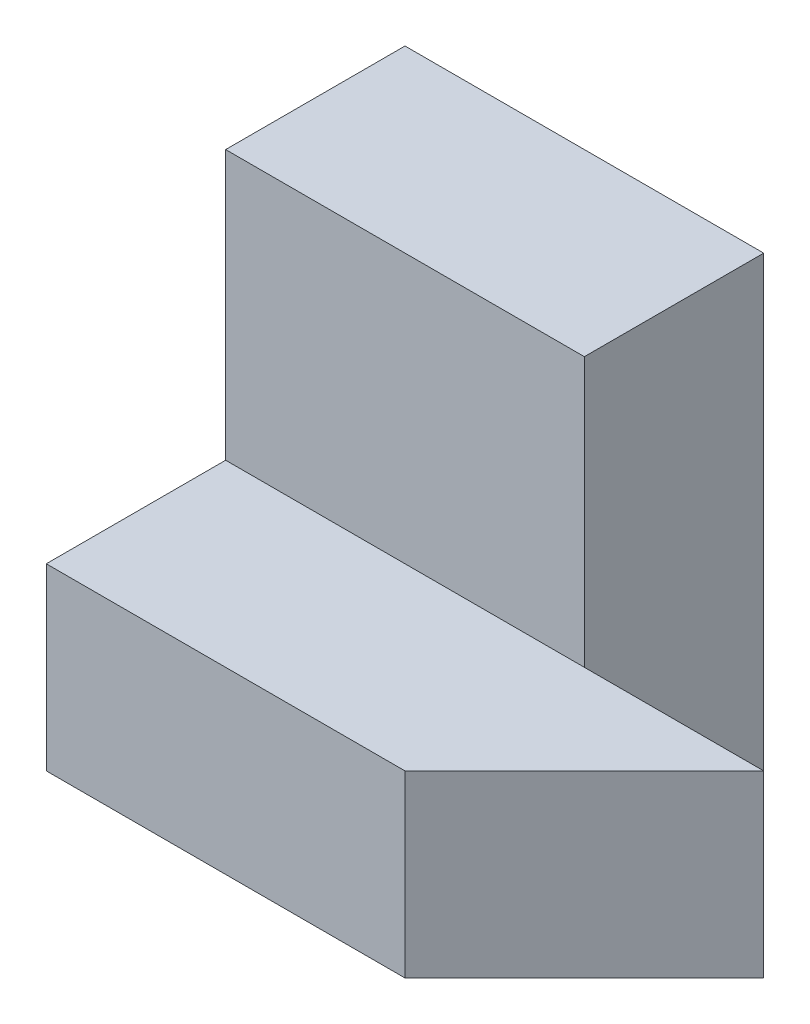
ISO-10303-21;
HEADER;
FILE_DESCRIPTION(('STEP AP214'),'2;1');
FILE_NAME('part.step','',(''),(''),'','','');
FILE_SCHEMA(('AUTOMOTIVE_DESIGN { 1 0 10303 214 1 1 1 1 }'));
ENDSEC;
DATA;
#1=APPLICATION_CONTEXT('core data for automotive mechanical design processes');
#2=APPLICATION_PROTOCOL_DEFINITION('international standard','automotive_design',2000,#1);
#3=PRODUCT_CONTEXT('',#1,'mechanical');
#4=PRODUCT('Part','Part','',(#3));
#5=PRODUCT_RELATED_PRODUCT_CATEGORY('part','',(#4));
#6=PRODUCT_DEFINITION_FORMATION('','',#4);
#7=PRODUCT_DEFINITION_CONTEXT('part definition',#1,'design');
#8=PRODUCT_DEFINITION('design','',#6,#7);
#9=PRODUCT_DEFINITION_SHAPE('','',#8);
#10=(LENGTH_UNIT() NAMED_UNIT(*) SI_UNIT(.MILLI.,.METRE.));
#11=(NAMED_UNIT(*) PLANE_ANGLE_UNIT() SI_UNIT($,.RADIAN.));
#12=(NAMED_UNIT(*) SI_UNIT($,.STERADIAN.) SOLID_ANGLE_UNIT());
#13=UNCERTAINTY_MEASURE_WITH_UNIT(LENGTH_MEASURE(1.E-05),#10,'distance_accuracy_value','');
#14=(GEOMETRIC_REPRESENTATION_CONTEXT(3) GLOBAL_UNCERTAINTY_ASSIGNED_CONTEXT((#13)) GLOBAL_UNIT_ASSIGNED_CONTEXT((#10,
#11,#12)) REPRESENTATION_CONTEXT('',''));
#15=CARTESIAN_POINT('',(0.,0.,0.));
#16=DIRECTION('',(0.,0.,1.));
#17=DIRECTION('',(1.,0.,0.));
#18=AXIS2_PLACEMENT_3D('',#15,#16,#17);
#19=CARTESIAN_POINT('',(2.,-2.5,2.));
#20=DIRECTION('',(-1.,0.,0.));
#21=DIRECTION('',(0.,0.,1.));
#22=AXIS2_PLACEMENT_3D('',#19,#20,#21);
#23=PLANE('',#22);
#24=DIRECTION('',(0.,1.,0.));
#25=VECTOR('',#24,1.);
#26=CARTESIAN_POINT('',(2.,-2.5,2.));
#27=LINE('',#26,#25);
#28=CARTESIAN_POINT('',(2.,-2.5,2.));
#29=VERTEX_POINT('',#28);
#30=CARTESIAN_POINT('',(2.,-0.5,2.));
#31=VERTEX_POINT('',#30);
#32=EDGE_CURVE('E49',#29,#31,#27,.T.);
#33=ORIENTED_EDGE('',*,*,#32,.F.);
#34=DIRECTION('',(0.,0.,-1.));
#35=VECTOR('',#34,1.);
#36=CARTESIAN_POINT('',(2.,-2.5,2.));
#37=LINE('',#36,#35);
#38=CARTESIAN_POINT('',(2.,-2.5,0.));
#39=VERTEX_POINT('',#38);
#40=EDGE_CURVE('E74',#29,#39,#37,.T.);
#41=ORIENTED_EDGE('',*,*,#40,.T.);
#42=DIRECTION('',(0.,1.,0.));
#43=VECTOR('',#42,1.);
#44=CARTESIAN_POINT('',(2.,-2.5,0.));
#45=LINE('',#44,#43);
#46=CARTESIAN_POINT('',(2.,2.5,0.));
#47=VERTEX_POINT('',#46);
#48=EDGE_CURVE('E78',#39,#47,#45,.T.);
#49=ORIENTED_EDGE('',*,*,#48,.T.);
#50=DIRECTION('',(0.,0.,-1.));
#51=VECTOR('',#50,1.);
#52=CARTESIAN_POINT('',(2.,2.5,2.));
#53=LINE('',#52,#51);
#54=CARTESIAN_POINT('',(2.,2.5,2.));
#55=VERTEX_POINT('',#54);
#56=EDGE_CURVE('E11',#55,#47,#53,.T.);
#57=ORIENTED_EDGE('',*,*,#56,.F.);
#58=DIRECTION('',(0.,1.,0.));
#59=VECTOR('',#58,1.);
#60=CARTESIAN_POINT('',(2.,-2.5,2.));
#61=LINE('',#60,#59);
#62=EDGE_CURVE('E93',#31,#55,#61,.T.);
#63=ORIENTED_EDGE('',*,*,#62,.F.);
#64=EDGE_LOOP('',(#33,#41,#49,#57,#63));
#65=FACE_BOUND('',#64,.T.);
#66=ADVANCED_FACE('F33',(#65),#23,.F.);
#67=CARTESIAN_POINT('',(0.,0.,2.));
#68=DIRECTION('',(0.,0.,-1.));
#69=DIRECTION('',(-1.,0.,0.));
#70=AXIS2_PLACEMENT_3D('',#67,#68,#69);
#71=PLANE('',#70);
#72=DIRECTION('',(-1.,0.,0.));
#73=VECTOR('',#72,1.);
#74=CARTESIAN_POINT('',(-2.,-0.5,2.));
#75=LINE('',#74,#73);
#76=CARTESIAN_POINT('',(-2.,-0.5,2.));
#77=VERTEX_POINT('',#76);
#78=EDGE_CURVE('E117',#31,#77,#75,.T.);
#79=ORIENTED_EDGE('',*,*,#78,.F.);
#80=ORIENTED_EDGE('',*,*,#62,.T.);
#81=DIRECTION('',(-1.,0.,0.));
#82=VECTOR('',#81,1.);
#83=CARTESIAN_POINT('',(-2.,2.5,2.));
#84=LINE('',#83,#82);
#85=CARTESIAN_POINT('',(-2.,2.5,2.));
#86=VERTEX_POINT('',#85);
#87=EDGE_CURVE('E58',#55,#86,#84,.T.);
#88=ORIENTED_EDGE('',*,*,#87,.T.);
#89=DIRECTION('',(0.,-1.,0.));
#90=VECTOR('',#89,1.);
#91=CARTESIAN_POINT('',(-2.,-2.5,2.));
#92=LINE('',#91,#90);
#93=EDGE_CURVE('E83',#86,#77,#92,.T.);
#94=ORIENTED_EDGE('',*,*,#93,.T.);
#95=EDGE_LOOP('',(#79,#80,#88,#94));
#96=FACE_BOUND('',#95,.T.);
#97=ADVANCED_FACE('F158',(#96),#71,.F.);
#98=CARTESIAN_POINT('',(-2.,2.5,2.));
#99=DIRECTION('',(0.,-1.,0.));
#100=DIRECTION('',(0.,0.,-1.));
#101=AXIS2_PLACEMENT_3D('',#98,#99,#100);
#102=PLANE('',#101);
#103=DIRECTION('',(-1.,0.,0.));
#104=VECTOR('',#103,1.);
#105=CARTESIAN_POINT('',(-2.,2.5,0.));
#106=LINE('',#105,#104);
#107=CARTESIAN_POINT('',(-2.,2.5,0.));
#108=VERTEX_POINT('',#107);
#109=EDGE_CURVE('E97',#47,#108,#106,.T.);
#110=ORIENTED_EDGE('',*,*,#109,.T.);
#111=DIRECTION('',(0.,0.,-1.));
#112=VECTOR('',#111,1.);
#113=CARTESIAN_POINT('',(-2.,2.5,2.));
#114=LINE('',#113,#112);
#115=EDGE_CURVE('E41',#86,#108,#114,.T.);
#116=ORIENTED_EDGE('',*,*,#115,.F.);
#117=ORIENTED_EDGE('',*,*,#87,.F.);
#118=ORIENTED_EDGE('',*,*,#56,.T.);
#119=EDGE_LOOP('',(#110,#116,#117,#118));
#120=FACE_BOUND('',#119,.T.);
#121=ADVANCED_FACE('F152',(#120),#102,.F.);
#122=CARTESIAN_POINT('',(-2.,-2.5,2.));
#123=DIRECTION('',(1.,0.,0.));
#124=DIRECTION('',(0.,0.,-1.));
#125=AXIS2_PLACEMENT_3D('',#122,#123,#124);
#126=PLANE('',#125);
#127=DIRECTION('',(0.,-1.,0.));
#128=VECTOR('',#127,1.);
#129=CARTESIAN_POINT('',(-2.,-2.5,0.));
#130=LINE('',#129,#128);
#131=CARTESIAN_POINT('',(-2.,-2.5,0.));
#132=VERTEX_POINT('',#131);
#133=EDGE_CURVE('E94',#108,#132,#130,.T.);
#134=ORIENTED_EDGE('',*,*,#133,.T.);
#135=DIRECTION('',(0.,0.,-1.));
#136=VECTOR('',#135,1.);
#137=CARTESIAN_POINT('',(-2.,-2.5,2.));
#138=LINE('',#137,#136);
#139=CARTESIAN_POINT('',(-2.,-2.5,4.));
#140=VERTEX_POINT('',#139);
#141=EDGE_CURVE('E82',#140,#132,#138,.T.);
#142=ORIENTED_EDGE('',*,*,#141,.F.);
#143=DIRECTION('',(0.,-1.,0.));
#144=VECTOR('',#143,1.);
#145=CARTESIAN_POINT('',(-2.,-2.5,4.));
#146=LINE('',#145,#144);
#147=CARTESIAN_POINT('',(-2.,-0.5,4.));
#148=VERTEX_POINT('',#147);
#149=EDGE_CURVE('E129',#148,#140,#146,.T.);
#150=ORIENTED_EDGE('',*,*,#149,.F.);
#151=DIRECTION('',(0.,0.,-1.));
#152=VECTOR('',#151,1.);
#153=CARTESIAN_POINT('',(-2.,-0.5,4.));
#154=LINE('',#153,#152);
#155=EDGE_CURVE('E98',#148,#77,#154,.T.);
#156=ORIENTED_EDGE('',*,*,#155,.T.);
#157=ORIENTED_EDGE('',*,*,#93,.F.);
#158=ORIENTED_EDGE('',*,*,#115,.T.);
#159=EDGE_LOOP('',(#134,#142,#150,#156,#157,#158));
#160=FACE_BOUND('',#159,.T.);
#161=ADVANCED_FACE('F150',(#160),#126,.F.);
#162=CARTESIAN_POINT('',(-2.,-2.5,2.));
#163=DIRECTION('',(0.,1.,0.));
#164=DIRECTION('',(0.,0.,1.));
#165=AXIS2_PLACEMENT_3D('',#162,#163,#164);
#166=PLANE('',#165);
#167=DIRECTION('',(1.,0.,0.));
#168=VECTOR('',#167,1.);
#169=CARTESIAN_POINT('',(-2.,-2.5,0.));
#170=LINE('',#169,#168);
#171=EDGE_CURVE('E87',#132,#39,#170,.T.);
#172=ORIENTED_EDGE('',*,*,#171,.T.);
#173=ORIENTED_EDGE('',*,*,#40,.F.);
#174=DIRECTION('',(-1.,0.,0.));
#175=VECTOR('',#174,1.);
#176=CARTESIAN_POINT('',(4.,-2.5,2.));
#177=LINE('',#176,#175);
#178=CARTESIAN_POINT('',(4.,-2.5,2.));
#179=VERTEX_POINT('',#178);
#180=EDGE_CURVE('E128',#179,#29,#177,.T.);
#181=ORIENTED_EDGE('',*,*,#180,.F.);
#182=DIRECTION('',(0.707106781186547,0.,-0.707106781186548));
#183=VECTOR('',#182,1.);
#184=CARTESIAN_POINT('',(2.,-2.5,4.));
#185=LINE('',#184,#183);
#186=CARTESIAN_POINT('',(2.,-2.5,4.));
#187=VERTEX_POINT('',#186);
#188=EDGE_CURVE('E171',#187,#179,#185,.T.);
#189=ORIENTED_EDGE('',*,*,#188,.F.);
#190=DIRECTION('',(1.,0.,0.));
#191=VECTOR('',#190,1.);
#192=CARTESIAN_POINT('',(-2.,-2.5,4.));
#193=LINE('',#192,#191);
#194=EDGE_CURVE('E132',#140,#187,#193,.T.);
#195=ORIENTED_EDGE('',*,*,#194,.F.);
#196=ORIENTED_EDGE('',*,*,#141,.T.);
#197=EDGE_LOOP('',(#172,#173,#181,#189,#195,#196));
#198=FACE_BOUND('',#197,.T.);
#199=ADVANCED_FACE('F88',(#198),#166,.F.);
#200=CARTESIAN_POINT('',(0.,0.,0.));
#201=DIRECTION('',(0.,0.,-1.));
#202=DIRECTION('',(-1.,0.,0.));
#203=AXIS2_PLACEMENT_3D('',#200,#201,#202);
#204=PLANE('',#203);
#205=ORIENTED_EDGE('',*,*,#48,.F.);
#206=ORIENTED_EDGE('',*,*,#171,.F.);
#207=ORIENTED_EDGE('',*,*,#133,.F.);
#208=ORIENTED_EDGE('',*,*,#109,.F.);
#209=EDGE_LOOP('',(#205,#206,#207,#208));
#210=FACE_BOUND('',#209,.T.);
#211=ADVANCED_FACE('F96',(#210),#204,.T.);
#212=CARTESIAN_POINT('',(-2.,-0.5,4.));
#213=DIRECTION('',(0.,-1.,0.));
#214=DIRECTION('',(0.,0.,-1.));
#215=AXIS2_PLACEMENT_3D('',#212,#213,#214);
#216=PLANE('',#215);
#217=ORIENTED_EDGE('',*,*,#78,.T.);
#218=ORIENTED_EDGE('',*,*,#155,.F.);
#219=DIRECTION('',(-1.,0.,0.));
#220=VECTOR('',#219,1.);
#221=CARTESIAN_POINT('',(-2.,-0.5,4.));
#222=LINE('',#221,#220);
#223=CARTESIAN_POINT('',(2.,-0.5,4.));
#224=VERTEX_POINT('',#223);
#225=EDGE_CURVE('E102',#224,#148,#222,.T.);
#226=ORIENTED_EDGE('',*,*,#225,.F.);
#227=DIRECTION('',(0.707106781186547,0.,-0.707106781186548));
#228=VECTOR('',#227,1.);
#229=CARTESIAN_POINT('',(2.,-0.5,4.));
#230=LINE('',#229,#228);
#231=CARTESIAN_POINT('',(4.,-0.5,2.));
#232=VERTEX_POINT('',#231);
#233=EDGE_CURVE('E124',#224,#232,#230,.T.);
#234=ORIENTED_EDGE('',*,*,#233,.T.);
#235=DIRECTION('',(-1.,0.,0.));
#236=VECTOR('',#235,1.);
#237=CARTESIAN_POINT('',(4.,-0.5,2.));
#238=LINE('',#237,#236);
#239=EDGE_CURVE('E119',#232,#31,#238,.T.);
#240=ORIENTED_EDGE('',*,*,#239,.T.);
#241=EDGE_LOOP('',(#217,#218,#226,#234,#240));
#242=FACE_BOUND('',#241,.T.);
#243=ADVANCED_FACE('F168',(#242),#216,.F.);
#244=CARTESIAN_POINT('',(0.,0.,4.));
#245=DIRECTION('',(0.,0.,-1.));
#246=DIRECTION('',(-1.,0.,0.));
#247=AXIS2_PLACEMENT_3D('',#244,#245,#246);
#248=PLANE('',#247);
#249=ORIENTED_EDGE('',*,*,#149,.T.);
#250=ORIENTED_EDGE('',*,*,#194,.T.);
#251=DIRECTION('',(0.,1.,0.));
#252=VECTOR('',#251,1.);
#253=CARTESIAN_POINT('',(2.,-2.5,4.));
#254=LINE('',#253,#252);
#255=EDGE_CURVE('E135',#187,#224,#254,.T.);
#256=ORIENTED_EDGE('',*,*,#255,.T.);
#257=ORIENTED_EDGE('',*,*,#225,.T.);
#258=EDGE_LOOP('',(#249,#250,#256,#257));
#259=FACE_BOUND('',#258,.T.);
#260=ADVANCED_FACE('F187',(#259),#248,.F.);
#261=CARTESIAN_POINT('',(4.,-2.5,2.));
#262=DIRECTION('',(0.,0.,-1.));
#263=DIRECTION('',(-1.,0.,0.));
#264=AXIS2_PLACEMENT_3D('',#261,#262,#263);
#265=PLANE('',#264);
#266=ORIENTED_EDGE('',*,*,#239,.F.);
#267=DIRECTION('',(0.,1.,0.));
#268=VECTOR('',#267,1.);
#269=CARTESIAN_POINT('',(4.,-2.5,2.));
#270=LINE('',#269,#268);
#271=EDGE_CURVE('E118',#179,#232,#270,.T.);
#272=ORIENTED_EDGE('',*,*,#271,.F.);
#273=ORIENTED_EDGE('',*,*,#180,.T.);
#274=ORIENTED_EDGE('',*,*,#32,.T.);
#275=EDGE_LOOP('',(#266,#272,#273,#274));
#276=FACE_BOUND('',#275,.T.);
#277=ADVANCED_FACE('F165',(#276),#265,.T.);
#278=CARTESIAN_POINT('',(2.,-2.5,4.));
#279=DIRECTION('',(0.707106781186548,0.,0.707106781186547));
#280=DIRECTION('',(0.707106781186547,0.,-0.707106781186548));
#281=AXIS2_PLACEMENT_3D('',#278,#279,#280);
#282=PLANE('',#281);
#283=ORIENTED_EDGE('',*,*,#233,.F.);
#284=ORIENTED_EDGE('',*,*,#255,.F.);
#285=ORIENTED_EDGE('',*,*,#188,.T.);
#286=ORIENTED_EDGE('',*,*,#271,.T.);
#287=EDGE_LOOP('',(#283,#284,#285,#286));
#288=FACE_BOUND('',#287,.T.);
#289=ADVANCED_FACE('F177',(#288),#282,.T.);
#290=CLOSED_SHELL('',(#66,#97,#121,#161,#199,#211,#243,#260,#277,#289));
#291=MANIFOLD_SOLID_BREP('B2',#290);
#292=ADVANCED_BREP_SHAPE_REPRESENTATION('',(#18,#291),#14);
#293=SHAPE_DEFINITION_REPRESENTATION(#9,#292);
ENDSEC;
END-ISO-10303-21;
